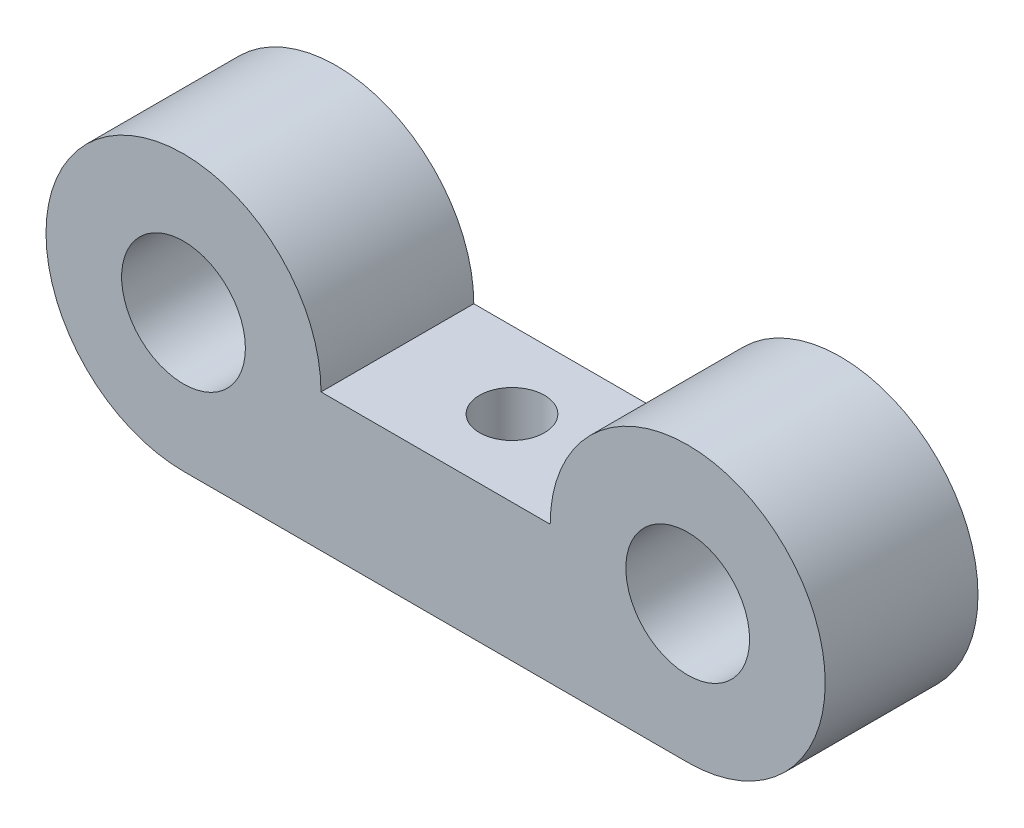
ISO-10303-21;
HEADER;
FILE_DESCRIPTION(('STEP AP214'),'2;1');
FILE_NAME('part.step','',(''),(''),'','','');
FILE_SCHEMA(('AUTOMOTIVE_DESIGN { 1 0 10303 214 1 1 1 1 }'));
ENDSEC;
DATA;
#1=APPLICATION_CONTEXT('core data for automotive mechanical design processes');
#2=APPLICATION_PROTOCOL_DEFINITION('international standard','automotive_design',2000,#1);
#3=PRODUCT_CONTEXT('',#1,'mechanical');
#4=PRODUCT('Part','Part','',(#3));
#5=PRODUCT_RELATED_PRODUCT_CATEGORY('part','',(#4));
#6=PRODUCT_DEFINITION_FORMATION('','',#4);
#7=PRODUCT_DEFINITION_CONTEXT('part definition',#1,'design');
#8=PRODUCT_DEFINITION('design','',#6,#7);
#9=PRODUCT_DEFINITION_SHAPE('','',#8);
#10=(LENGTH_UNIT() NAMED_UNIT(*) SI_UNIT(.MILLI.,.METRE.));
#11=(NAMED_UNIT(*) PLANE_ANGLE_UNIT() SI_UNIT($,.RADIAN.));
#12=(NAMED_UNIT(*) SI_UNIT($,.STERADIAN.) SOLID_ANGLE_UNIT());
#13=UNCERTAINTY_MEASURE_WITH_UNIT(LENGTH_MEASURE(1.E-05),#10,'distance_accuracy_value','');
#14=(GEOMETRIC_REPRESENTATION_CONTEXT(3) GLOBAL_UNCERTAINTY_ASSIGNED_CONTEXT((#13)) GLOBAL_UNIT_ASSIGNED_CONTEXT((#10,
#11,#12)) REPRESENTATION_CONTEXT('',''));
#15=CARTESIAN_POINT('',(0.,0.,0.));
#16=DIRECTION('',(0.,0.,1.));
#17=DIRECTION('',(1.,0.,0.));
#18=AXIS2_PLACEMENT_3D('',#15,#16,#17);
#19=CARTESIAN_POINT('',(-16.5,0.,10.));
#20=DIRECTION('',(0.,0.,1.));
#21=DIRECTION('',(1.,0.,0.));
#22=AXIS2_PLACEMENT_3D('',#19,#20,#21);
#23=PLANE('',#22);
#24=CARTESIAN_POINT('',(-16.5,0.,10.));
#25=DIRECTION('',(0.,0.,1.));
#26=DIRECTION('',(1.,0.,0.));
#27=AXIS2_PLACEMENT_3D('',#24,#25,#26);
#28=CIRCLE('',#27,4.05);
#29=CARTESIAN_POINT('',(-12.45,0.,10.));
#30=VERTEX_POINT('',#29);
#31=EDGE_CURVE('E100',#30,#30,#28,.T.);
#32=ORIENTED_EDGE('',*,*,#31,.F.);
#33=EDGE_LOOP('',(#32));
#34=FACE_BOUND('',#33,.T.);
#35=CARTESIAN_POINT('',(-16.5,0.,10.));
#36=DIRECTION('',(0.,0.,1.));
#37=DIRECTION('',(1.,0.,0.));
#38=AXIS2_PLACEMENT_3D('',#35,#36,#37);
#39=CIRCLE('',#38,9.);
#40=CARTESIAN_POINT('',(-7.5,0.,10.));
#41=VERTEX_POINT('',#40);
#42=CARTESIAN_POINT('',(-16.5,-8.99999999999999,10.));
#43=VERTEX_POINT('',#42);
#44=EDGE_CURVE('E85',#41,#43,#39,.T.);
#45=ORIENTED_EDGE('',*,*,#44,.T.);
#46=DIRECTION('',(1.,0.,0.));
#47=VECTOR('',#46,1.);
#48=CARTESIAN_POINT('',(-16.5,-8.99999999999999,10.));
#49=LINE('',#48,#47);
#50=CARTESIAN_POINT('',(16.5,-8.99999999999999,10.));
#51=VERTEX_POINT('',#50);
#52=EDGE_CURVE('E80',#43,#51,#49,.T.);
#53=ORIENTED_EDGE('',*,*,#52,.T.);
#54=CARTESIAN_POINT('',(16.5,0.,10.));
#55=DIRECTION('',(0.,0.,1.));
#56=DIRECTION('',(1.,0.,0.));
#57=AXIS2_PLACEMENT_3D('',#54,#55,#56);
#58=CIRCLE('',#57,9.);
#59=CARTESIAN_POINT('',(7.5,0.,10.));
#60=VERTEX_POINT('',#59);
#61=EDGE_CURVE('E83',#51,#60,#58,.T.);
#62=ORIENTED_EDGE('',*,*,#61,.T.);
#63=DIRECTION('',(-1.,0.,0.));
#64=VECTOR('',#63,1.);
#65=CARTESIAN_POINT('',(-7.5,0.,10.));
#66=LINE('',#65,#64);
#67=EDGE_CURVE('E50',#60,#41,#66,.T.);
#68=ORIENTED_EDGE('',*,*,#67,.T.);
#69=EDGE_LOOP('',(#45,#53,#62,#68));
#70=FACE_BOUND('',#69,.T.);
#71=CARTESIAN_POINT('',(16.5,0.,10.));
#72=DIRECTION('',(0.,0.,1.));
#73=DIRECTION('',(1.,0.,0.));
#74=AXIS2_PLACEMENT_3D('',#71,#72,#73);
#75=CIRCLE('',#74,4.05);
#76=CARTESIAN_POINT('',(20.55,0.,10.));
#77=VERTEX_POINT('',#76);
#78=EDGE_CURVE('E115',#77,#77,#75,.T.);
#79=ORIENTED_EDGE('',*,*,#78,.F.);
#80=EDGE_LOOP('',(#79));
#81=FACE_BOUND('',#80,.T.);
#82=ADVANCED_FACE('F33',(#34,#70,#81),#23,.T.);
#83=CARTESIAN_POINT('',(-16.5,0.,0.));
#84=DIRECTION('',(0.,0.,1.));
#85=DIRECTION('',(1.,0.,0.));
#86=AXIS2_PLACEMENT_3D('',#83,#84,#85);
#87=PLANE('',#86);
#88=CARTESIAN_POINT('',(-16.5,0.,0.));
#89=DIRECTION('',(0.,0.,1.));
#90=DIRECTION('',(1.,0.,0.));
#91=AXIS2_PLACEMENT_3D('',#88,#89,#90);
#92=CIRCLE('',#91,9.);
#93=CARTESIAN_POINT('',(-7.5,0.,0.));
#94=VERTEX_POINT('',#93);
#95=CARTESIAN_POINT('',(-16.5,-8.99999999999999,0.));
#96=VERTEX_POINT('',#95);
#97=EDGE_CURVE('E97',#94,#96,#92,.T.);
#98=ORIENTED_EDGE('',*,*,#97,.F.);
#99=DIRECTION('',(-1.,0.,0.));
#100=VECTOR('',#99,1.);
#101=CARTESIAN_POINT('',(-7.5,0.,0.));
#102=LINE('',#101,#100);
#103=CARTESIAN_POINT('',(7.5,0.,0.));
#104=VERTEX_POINT('',#103);
#105=EDGE_CURVE('E73',#104,#94,#102,.T.);
#106=ORIENTED_EDGE('',*,*,#105,.F.);
#107=CARTESIAN_POINT('',(16.5,0.,0.));
#108=DIRECTION('',(0.,0.,1.));
#109=DIRECTION('',(1.,0.,0.));
#110=AXIS2_PLACEMENT_3D('',#107,#108,#109);
#111=CIRCLE('',#110,9.);
#112=CARTESIAN_POINT('',(16.5,-8.99999999999999,0.));
#113=VERTEX_POINT('',#112);
#114=EDGE_CURVE('E67',#113,#104,#111,.T.);
#115=ORIENTED_EDGE('',*,*,#114,.F.);
#116=DIRECTION('',(1.,0.,0.));
#117=VECTOR('',#116,1.);
#118=CARTESIAN_POINT('',(-16.5,-8.99999999999999,0.));
#119=LINE('',#118,#117);
#120=EDGE_CURVE('E89',#96,#113,#119,.T.);
#121=ORIENTED_EDGE('',*,*,#120,.F.);
#122=EDGE_LOOP('',(#98,#106,#115,#121));
#123=FACE_BOUND('',#122,.T.);
#124=CARTESIAN_POINT('',(-16.5,0.,0.));
#125=DIRECTION('',(0.,0.,1.));
#126=DIRECTION('',(1.,0.,0.));
#127=AXIS2_PLACEMENT_3D('',#124,#125,#126);
#128=CIRCLE('',#127,4.05);
#129=CARTESIAN_POINT('',(-12.45,0.,0.));
#130=VERTEX_POINT('',#129);
#131=EDGE_CURVE('E112',#130,#130,#128,.T.);
#132=ORIENTED_EDGE('',*,*,#131,.T.);
#133=EDGE_LOOP('',(#132));
#134=FACE_BOUND('',#133,.T.);
#135=CARTESIAN_POINT('',(16.5,0.,0.));
#136=DIRECTION('',(0.,0.,1.));
#137=DIRECTION('',(1.,0.,0.));
#138=AXIS2_PLACEMENT_3D('',#135,#136,#137);
#139=CIRCLE('',#138,4.05);
#140=CARTESIAN_POINT('',(20.55,0.,0.));
#141=VERTEX_POINT('',#140);
#142=EDGE_CURVE('E118',#141,#141,#139,.T.);
#143=ORIENTED_EDGE('',*,*,#142,.T.);
#144=EDGE_LOOP('',(#143));
#145=FACE_BOUND('',#144,.T.);
#146=ADVANCED_FACE('F108',(#123,#134,#145),#87,.F.);
#147=CARTESIAN_POINT('',(-16.5,0.,10.));
#148=DIRECTION('',(0.,0.,-1.));
#149=DIRECTION('',(-1.,0.,0.));
#150=AXIS2_PLACEMENT_3D('',#147,#148,#149);
#151=CYLINDRICAL_SURFACE('',#150,9.);
#152=ORIENTED_EDGE('',*,*,#97,.T.);
#153=DIRECTION('',(0.,0.,-1.));
#154=VECTOR('',#153,1.);
#155=CARTESIAN_POINT('',(-16.5,-8.99999999999999,10.));
#156=LINE('',#155,#154);
#157=EDGE_CURVE('E11',#43,#96,#156,.T.);
#158=ORIENTED_EDGE('',*,*,#157,.F.);
#159=ORIENTED_EDGE('',*,*,#44,.F.);
#160=DIRECTION('',(0.,0.,-1.));
#161=VECTOR('',#160,1.);
#162=CARTESIAN_POINT('',(-7.5,0.,10.));
#163=LINE('',#162,#161);
#164=EDGE_CURVE('E93',#41,#94,#163,.T.);
#165=ORIENTED_EDGE('',*,*,#164,.T.);
#166=EDGE_LOOP('',(#152,#158,#159,#165));
#167=FACE_BOUND('',#166,.T.);
#168=ADVANCED_FACE('F35',(#167),#151,.T.);
#169=CARTESIAN_POINT('',(-16.5,-8.99999999999999,10.));
#170=DIRECTION('',(0.,1.,0.));
#171=DIRECTION('',(-1.,0.,0.));
#172=AXIS2_PLACEMENT_3D('',#169,#170,#171);
#173=PLANE('',#172);
#174=CARTESIAN_POINT('',(0.,-8.99999999999999,5.));
#175=DIRECTION('',(0.,1.,0.));
#176=DIRECTION('',(-1.,0.,0.));
#177=AXIS2_PLACEMENT_3D('',#174,#175,#176);
#178=CIRCLE('',#177,2.125);
#179=CARTESIAN_POINT('',(-2.125,-8.99999999999999,5.));
#180=VERTEX_POINT('',#179);
#181=EDGE_CURVE('E121',#180,#180,#178,.T.);
#182=ORIENTED_EDGE('',*,*,#181,.T.);
#183=EDGE_LOOP('',(#182));
#184=FACE_BOUND('',#183,.T.);
#185=ORIENTED_EDGE('',*,*,#120,.T.);
#186=DIRECTION('',(0.,0.,-1.));
#187=VECTOR('',#186,1.);
#188=CARTESIAN_POINT('',(16.5,-8.99999999999999,10.));
#189=LINE('',#188,#187);
#190=EDGE_CURVE('E42',#51,#113,#189,.T.);
#191=ORIENTED_EDGE('',*,*,#190,.F.);
#192=ORIENTED_EDGE('',*,*,#52,.F.);
#193=ORIENTED_EDGE('',*,*,#157,.T.);
#194=EDGE_LOOP('',(#185,#191,#192,#193));
#195=FACE_BOUND('',#194,.T.);
#196=ADVANCED_FACE('F88',(#184,#195),#173,.F.);
#197=CARTESIAN_POINT('',(16.5,0.,10.));
#198=DIRECTION('',(0.,0.,-1.));
#199=DIRECTION('',(-1.,0.,0.));
#200=AXIS2_PLACEMENT_3D('',#197,#198,#199);
#201=CYLINDRICAL_SURFACE('',#200,9.);
#202=ORIENTED_EDGE('',*,*,#114,.T.);
#203=DIRECTION('',(0.,0.,-1.));
#204=VECTOR('',#203,1.);
#205=CARTESIAN_POINT('',(7.5,0.,10.));
#206=LINE('',#205,#204);
#207=EDGE_CURVE('E90',#60,#104,#206,.T.);
#208=ORIENTED_EDGE('',*,*,#207,.F.);
#209=ORIENTED_EDGE('',*,*,#61,.F.);
#210=ORIENTED_EDGE('',*,*,#190,.T.);
#211=EDGE_LOOP('',(#202,#208,#209,#210));
#212=FACE_BOUND('',#211,.T.);
#213=ADVANCED_FACE('F91',(#212),#201,.T.);
#214=CARTESIAN_POINT('',(-7.5,0.,10.));
#215=DIRECTION('',(0.,-1.,0.));
#216=DIRECTION('',(1.,0.,0.));
#217=AXIS2_PLACEMENT_3D('',#214,#215,#216);
#218=PLANE('',#217);
#219=CARTESIAN_POINT('',(0.,0.,5.));
#220=DIRECTION('',(0.,1.,0.));
#221=DIRECTION('',(-1.,0.,0.));
#222=AXIS2_PLACEMENT_3D('',#219,#220,#221);
#223=CIRCLE('',#222,2.125);
#224=CARTESIAN_POINT('',(-2.125,0.,5.));
#225=VERTEX_POINT('',#224);
#226=EDGE_CURVE('E126',#225,#225,#223,.T.);
#227=ORIENTED_EDGE('',*,*,#226,.F.);
#228=EDGE_LOOP('',(#227));
#229=FACE_BOUND('',#228,.T.);
#230=ORIENTED_EDGE('',*,*,#105,.T.);
#231=ORIENTED_EDGE('',*,*,#164,.F.);
#232=ORIENTED_EDGE('',*,*,#67,.F.);
#233=ORIENTED_EDGE('',*,*,#207,.T.);
#234=EDGE_LOOP('',(#230,#231,#232,#233));
#235=FACE_BOUND('',#234,.T.);
#236=ADVANCED_FACE('F105',(#229,#235),#218,.F.);
#237=CARTESIAN_POINT('',(-16.5,0.,10.));
#238=DIRECTION('',(0.,0.,-1.));
#239=DIRECTION('',(-1.,0.,0.));
#240=AXIS2_PLACEMENT_3D('',#237,#238,#239);
#241=CYLINDRICAL_SURFACE('',#240,4.05);
#242=ORIENTED_EDGE('',*,*,#31,.T.);
#243=EDGE_LOOP('',(#242));
#244=FACE_BOUND('',#243,.T.);
#245=ORIENTED_EDGE('',*,*,#131,.F.);
#246=EDGE_LOOP('',(#245));
#247=FACE_BOUND('',#246,.T.);
#248=ADVANCED_FACE('F134',(#244,#247),#241,.F.);
#249=CARTESIAN_POINT('',(16.5,0.,10.));
#250=DIRECTION('',(0.,0.,-1.));
#251=DIRECTION('',(-1.,0.,0.));
#252=AXIS2_PLACEMENT_3D('',#249,#250,#251);
#253=CYLINDRICAL_SURFACE('',#252,4.05);
#254=ORIENTED_EDGE('',*,*,#78,.T.);
#255=EDGE_LOOP('',(#254));
#256=FACE_BOUND('',#255,.T.);
#257=ORIENTED_EDGE('',*,*,#142,.F.);
#258=EDGE_LOOP('',(#257));
#259=FACE_BOUND('',#258,.T.);
#260=ADVANCED_FACE('F140',(#256,#259),#253,.F.);
#261=CARTESIAN_POINT('',(0.,-10.,5.));
#262=DIRECTION('',(0.,1.,0.));
#263=DIRECTION('',(-1.,0.,0.));
#264=AXIS2_PLACEMENT_3D('',#261,#262,#263);
#265=CYLINDRICAL_SURFACE('',#264,2.125);
#266=ORIENTED_EDGE('',*,*,#226,.T.);
#267=EDGE_LOOP('',(#266));
#268=FACE_BOUND('',#267,.T.);
#269=ORIENTED_EDGE('',*,*,#181,.F.);
#270=EDGE_LOOP('',(#269));
#271=FACE_BOUND('',#270,.T.);
#272=ADVANCED_FACE('F130',(#268,#271),#265,.F.);
#273=CLOSED_SHELL('',(#82,#146,#168,#196,#213,#236,#248,#260,#272));
#274=MANIFOLD_SOLID_BREP('B2',#273);
#275=ADVANCED_BREP_SHAPE_REPRESENTATION('',(#18,#274),#14);
#276=SHAPE_DEFINITION_REPRESENTATION(#9,#275);
ENDSEC;
END-ISO-10303-21;
